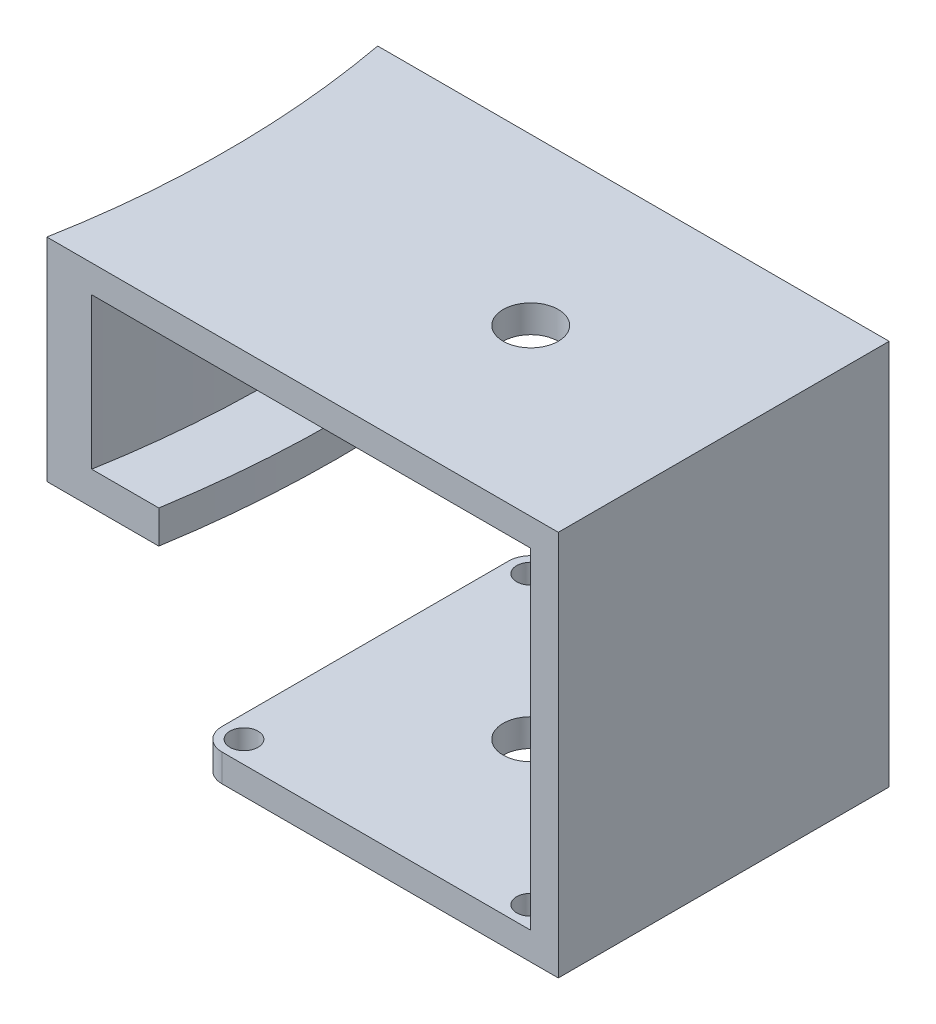
ISO-10303-21;
HEADER;
FILE_DESCRIPTION(('STEP AP214'),'2;1');
FILE_NAME('part.step','',(''),(''),'','','');
FILE_SCHEMA(('AUTOMOTIVE_DESIGN { 1 0 10303 214 1 1 1 1 }'));
ENDSEC;
DATA;
#1=APPLICATION_CONTEXT('core data for automotive mechanical design processes');
#2=APPLICATION_PROTOCOL_DEFINITION('international standard','automotive_design',2000,#1);
#3=PRODUCT_CONTEXT('',#1,'mechanical');
#4=PRODUCT('Part','Part','',(#3));
#5=PRODUCT_RELATED_PRODUCT_CATEGORY('part','',(#4));
#6=PRODUCT_DEFINITION_FORMATION('','',#4);
#7=PRODUCT_DEFINITION_CONTEXT('part definition',#1,'design');
#8=PRODUCT_DEFINITION('design','',#6,#7);
#9=PRODUCT_DEFINITION_SHAPE('','',#8);
#10=(LENGTH_UNIT() NAMED_UNIT(*) SI_UNIT(.MILLI.,.METRE.));
#11=(NAMED_UNIT(*) PLANE_ANGLE_UNIT() SI_UNIT($,.RADIAN.));
#12=(NAMED_UNIT(*) SI_UNIT($,.STERADIAN.) SOLID_ANGLE_UNIT());
#13=UNCERTAINTY_MEASURE_WITH_UNIT(LENGTH_MEASURE(1.E-05),#10,'distance_accuracy_value','');
#14=(GEOMETRIC_REPRESENTATION_CONTEXT(3) GLOBAL_UNCERTAINTY_ASSIGNED_CONTEXT((#13)) GLOBAL_UNIT_ASSIGNED_CONTEXT((#10,
#11,#12)) REPRESENTATION_CONTEXT('',''));
#15=CARTESIAN_POINT('',(0.,0.,0.));
#16=DIRECTION('',(0.,0.,1.));
#17=DIRECTION('',(1.,0.,0.));
#18=AXIS2_PLACEMENT_3D('',#15,#16,#17);
#19=CARTESIAN_POINT('',(30.,70.,-30.));
#20=DIRECTION('',(-1.,0.,0.));
#21=DIRECTION('',(0.,0.,1.));
#22=AXIS2_PLACEMENT_3D('',#19,#20,#21);
#23=PLANE('',#22);
#24=DIRECTION('',(0.,-1.,0.));
#25=VECTOR('',#24,1.);
#26=CARTESIAN_POINT('',(30.,70.,30.));
#27=LINE('',#26,#25);
#28=CARTESIAN_POINT('',(30.,65.,30.));
#29=VERTEX_POINT('',#28);
#30=CARTESIAN_POINT('',(30.,5.,30.));
#31=VERTEX_POINT('',#30);
#32=EDGE_CURVE('E204',#29,#31,#27,.T.);
#33=ORIENTED_EDGE('',*,*,#32,.F.);
#34=DIRECTION('',(0.,0.,-1.));
#35=VECTOR('',#34,1.);
#36=CARTESIAN_POINT('',(30.,65.,30.));
#37=LINE('',#36,#35);
#38=CARTESIAN_POINT('',(30.,65.,-30.));
#39=VERTEX_POINT('',#38);
#40=EDGE_CURVE('E53',#29,#39,#37,.T.);
#41=ORIENTED_EDGE('',*,*,#40,.T.);
#42=DIRECTION('',(0.,-1.,0.));
#43=VECTOR('',#42,1.);
#44=CARTESIAN_POINT('',(30.,70.,-30.));
#45=LINE('',#44,#43);
#46=CARTESIAN_POINT('',(30.,5.,-30.));
#47=VERTEX_POINT('',#46);
#48=EDGE_CURVE('E201',#39,#47,#45,.T.);
#49=ORIENTED_EDGE('',*,*,#48,.T.);
#50=DIRECTION('',(0.,0.,-1.));
#51=VECTOR('',#50,1.);
#52=CARTESIAN_POINT('',(30.,5.,30.));
#53=LINE('',#52,#51);
#54=EDGE_CURVE('E242',#31,#47,#53,.T.);
#55=ORIENTED_EDGE('',*,*,#54,.F.);
#56=EDGE_LOOP('',(#33,#41,#49,#55));
#57=FACE_BOUND('',#56,.T.);
#58=ADVANCED_FACE('F38',(#57),#23,.T.);
#59=CARTESIAN_POINT('',(-26.,5.,-26.));
#60=DIRECTION('',(0.,-1.,0.));
#61=DIRECTION('',(0.,0.,-1.));
#62=AXIS2_PLACEMENT_3D('',#59,#60,#61);
#63=PLANE('',#62);
#64=CARTESIAN_POINT('',(0.,5.,0.));
#65=DIRECTION('',(0.,1.,0.));
#66=DIRECTION('',(0.,0.,1.));
#67=AXIS2_PLACEMENT_3D('',#64,#65,#66);
#68=CIRCLE('',#67,5.);
#69=CARTESIAN_POINT('',(0.,5.,5.));
#70=VERTEX_POINT('',#69);
#71=EDGE_CURVE('E206',#70,#70,#68,.T.);
#72=ORIENTED_EDGE('',*,*,#71,.F.);
#73=EDGE_LOOP('',(#72));
#74=FACE_BOUND('',#73,.T.);
#75=ORIENTED_EDGE('',*,*,#54,.T.);
#76=DIRECTION('',(-1.,0.,0.));
#77=VECTOR('',#76,1.);
#78=CARTESIAN_POINT('',(-26.,5.,-30.));
#79=LINE('',#78,#77);
#80=CARTESIAN_POINT('',(-26.,5.,-30.));
#81=VERTEX_POINT('',#80);
#82=EDGE_CURVE('E245',#47,#81,#79,.T.);
#83=ORIENTED_EDGE('',*,*,#82,.T.);
#84=CARTESIAN_POINT('',(-26.,5.,-26.));
#85=DIRECTION('',(0.,1.,0.));
#86=DIRECTION('',(0.,0.,-1.));
#87=AXIS2_PLACEMENT_3D('',#84,#85,#86);
#88=CIRCLE('',#87,4.);
#89=CARTESIAN_POINT('',(-30.,5.,-26.));
#90=VERTEX_POINT('',#89);
#91=EDGE_CURVE('E248',#81,#90,#88,.T.);
#92=ORIENTED_EDGE('',*,*,#91,.T.);
#93=DIRECTION('',(0.,0.,1.));
#94=VECTOR('',#93,1.);
#95=CARTESIAN_POINT('',(-30.,5.,26.));
#96=LINE('',#95,#94);
#97=CARTESIAN_POINT('',(-30.,5.,26.));
#98=VERTEX_POINT('',#97);
#99=EDGE_CURVE('E250',#90,#98,#96,.T.);
#100=ORIENTED_EDGE('',*,*,#99,.T.);
#101=CARTESIAN_POINT('',(-26.,5.,26.));
#102=DIRECTION('',(0.,1.,0.));
#103=DIRECTION('',(0.,0.,-1.));
#104=AXIS2_PLACEMENT_3D('',#101,#102,#103);
#105=CIRCLE('',#104,4.);
#106=CARTESIAN_POINT('',(-26.,5.,30.));
#107=VERTEX_POINT('',#106);
#108=EDGE_CURVE('E252',#98,#107,#105,.T.);
#109=ORIENTED_EDGE('',*,*,#108,.T.);
#110=DIRECTION('',(1.,0.,0.));
#111=VECTOR('',#110,1.);
#112=CARTESIAN_POINT('',(-26.,5.,30.));
#113=LINE('',#112,#111);
#114=EDGE_CURVE('E254',#107,#31,#113,.T.);
#115=ORIENTED_EDGE('',*,*,#114,.T.);
#116=EDGE_LOOP('',(#75,#83,#92,#100,#109,#115));
#117=FACE_BOUND('',#116,.T.);
#118=CARTESIAN_POINT('',(26.,5.,-26.));
#119=DIRECTION('',(0.,1.,0.));
#120=DIRECTION('',(0.,0.,1.));
#121=AXIS2_PLACEMENT_3D('',#118,#119,#120);
#122=CIRCLE('',#121,2.55);
#123=CARTESIAN_POINT('',(26.,5.,-23.45));
#124=VERTEX_POINT('',#123);
#125=EDGE_CURVE('E236',#124,#124,#122,.T.);
#126=ORIENTED_EDGE('',*,*,#125,.F.);
#127=EDGE_LOOP('',(#126));
#128=FACE_BOUND('',#127,.T.);
#129=CARTESIAN_POINT('',(-26.,5.,-26.));
#130=DIRECTION('',(0.,1.,0.));
#131=DIRECTION('',(0.,0.,1.));
#132=AXIS2_PLACEMENT_3D('',#129,#130,#131);
#133=CIRCLE('',#132,2.55);
#134=CARTESIAN_POINT('',(-26.,5.,-23.45));
#135=VERTEX_POINT('',#134);
#136=EDGE_CURVE('E230',#135,#135,#133,.T.);
#137=ORIENTED_EDGE('',*,*,#136,.F.);
#138=EDGE_LOOP('',(#137));
#139=FACE_BOUND('',#138,.T.);
#140=CARTESIAN_POINT('',(-26.,5.,26.));
#141=DIRECTION('',(0.,1.,0.));
#142=DIRECTION('',(0.,0.,1.));
#143=AXIS2_PLACEMENT_3D('',#140,#141,#142);
#144=CIRCLE('',#143,2.55);
#145=CARTESIAN_POINT('',(-26.,5.,28.55));
#146=VERTEX_POINT('',#145);
#147=EDGE_CURVE('E224',#146,#146,#144,.T.);
#148=ORIENTED_EDGE('',*,*,#147,.F.);
#149=EDGE_LOOP('',(#148));
#150=FACE_BOUND('',#149,.T.);
#151=CARTESIAN_POINT('',(26.,5.,26.));
#152=DIRECTION('',(0.,1.,0.));
#153=DIRECTION('',(0.,0.,1.));
#154=AXIS2_PLACEMENT_3D('',#151,#152,#153);
#155=CIRCLE('',#154,2.55);
#156=CARTESIAN_POINT('',(26.,5.,28.55));
#157=VERTEX_POINT('',#156);
#158=EDGE_CURVE('E217',#157,#157,#155,.T.);
#159=ORIENTED_EDGE('',*,*,#158,.F.);
#160=EDGE_LOOP('',(#159));
#161=FACE_BOUND('',#160,.T.);
#162=ADVANCED_FACE('F284',(#74,#117,#128,#139,#150,#161),#63,.F.);
#163=CARTESIAN_POINT('',(-26.,0.,-26.));
#164=DIRECTION('',(0.,-1.,0.));
#165=DIRECTION('',(0.,0.,-1.));
#166=AXIS2_PLACEMENT_3D('',#163,#164,#165);
#167=PLANE('',#166);
#168=CARTESIAN_POINT('',(0.,0.,0.));
#169=DIRECTION('',(0.,-1.,0.));
#170=DIRECTION('',(0.,0.,-1.));
#171=AXIS2_PLACEMENT_3D('',#168,#169,#170);
#172=CIRCLE('',#171,5.);
#173=CARTESIAN_POINT('',(0.,0.,-5.));
#174=VERTEX_POINT('',#173);
#175=EDGE_CURVE('E216',#174,#174,#172,.T.);
#176=ORIENTED_EDGE('',*,*,#175,.F.);
#177=EDGE_LOOP('',(#176));
#178=FACE_BOUND('',#177,.T.);
#179=CARTESIAN_POINT('',(-26.,0.,26.));
#180=DIRECTION('',(0.,1.,0.));
#181=DIRECTION('',(0.,0.,1.));
#182=AXIS2_PLACEMENT_3D('',#179,#180,#181);
#183=CIRCLE('',#182,2.55);
#184=CARTESIAN_POINT('',(-26.,0.,28.55));
#185=VERTEX_POINT('',#184);
#186=EDGE_CURVE('E220',#185,#185,#183,.T.);
#187=ORIENTED_EDGE('',*,*,#186,.T.);
#188=EDGE_LOOP('',(#187));
#189=FACE_BOUND('',#188,.T.);
#190=CARTESIAN_POINT('',(26.,0.,-26.));
#191=DIRECTION('',(0.,1.,0.));
#192=DIRECTION('',(0.,0.,1.));
#193=AXIS2_PLACEMENT_3D('',#190,#191,#192);
#194=CIRCLE('',#193,2.55);
#195=CARTESIAN_POINT('',(26.,0.,-23.45));
#196=VERTEX_POINT('',#195);
#197=EDGE_CURVE('E233',#196,#196,#194,.T.);
#198=ORIENTED_EDGE('',*,*,#197,.T.);
#199=EDGE_LOOP('',(#198));
#200=FACE_BOUND('',#199,.T.);
#201=DIRECTION('',(-1.,0.,0.));
#202=VECTOR('',#201,1.);
#203=CARTESIAN_POINT('',(-26.,0.,-30.));
#204=LINE('',#203,#202);
#205=CARTESIAN_POINT('',(35.,0.,-30.));
#206=VERTEX_POINT('',#205);
#207=CARTESIAN_POINT('',(-26.,0.,-30.));
#208=VERTEX_POINT('',#207);
#209=EDGE_CURVE('E239',#206,#208,#204,.T.);
#210=ORIENTED_EDGE('',*,*,#209,.F.);
#211=DIRECTION('',(0.,0.,1.));
#212=VECTOR('',#211,1.);
#213=CARTESIAN_POINT('',(35.,0.,-30.));
#214=LINE('',#213,#212);
#215=CARTESIAN_POINT('',(35.,0.,30.));
#216=VERTEX_POINT('',#215);
#217=EDGE_CURVE('E193',#206,#216,#214,.T.);
#218=ORIENTED_EDGE('',*,*,#217,.T.);
#219=DIRECTION('',(1.,0.,0.));
#220=VECTOR('',#219,1.);
#221=CARTESIAN_POINT('',(-26.,0.,30.));
#222=LINE('',#221,#220);
#223=CARTESIAN_POINT('',(-26.,0.,30.));
#224=VERTEX_POINT('',#223);
#225=EDGE_CURVE('E246',#224,#216,#222,.T.);
#226=ORIENTED_EDGE('',*,*,#225,.F.);
#227=CARTESIAN_POINT('',(-26.,0.,26.));
#228=DIRECTION('',(0.,1.,0.));
#229=DIRECTION('',(0.,0.,-1.));
#230=AXIS2_PLACEMENT_3D('',#227,#228,#229);
#231=CIRCLE('',#230,4.);
#232=CARTESIAN_POINT('',(-30.,0.,26.));
#233=VERTEX_POINT('',#232);
#234=EDGE_CURVE('E263',#233,#224,#231,.T.);
#235=ORIENTED_EDGE('',*,*,#234,.F.);
#236=DIRECTION('',(0.,0.,1.));
#237=VECTOR('',#236,1.);
#238=CARTESIAN_POINT('',(-30.,0.,26.));
#239=LINE('',#238,#237);
#240=CARTESIAN_POINT('',(-30.,0.,-26.));
#241=VERTEX_POINT('',#240);
#242=EDGE_CURVE('E261',#241,#233,#239,.T.);
#243=ORIENTED_EDGE('',*,*,#242,.F.);
#244=CARTESIAN_POINT('',(-26.,0.,-26.));
#245=DIRECTION('',(0.,1.,0.));
#246=DIRECTION('',(0.,0.,-1.));
#247=AXIS2_PLACEMENT_3D('',#244,#245,#246);
#248=CIRCLE('',#247,4.);
#249=EDGE_CURVE('E259',#208,#241,#248,.T.);
#250=ORIENTED_EDGE('',*,*,#249,.F.);
#251=EDGE_LOOP('',(#210,#218,#226,#235,#243,#250));
#252=FACE_BOUND('',#251,.T.);
#253=CARTESIAN_POINT('',(-26.,0.,-26.));
#254=DIRECTION('',(0.,1.,0.));
#255=DIRECTION('',(0.,0.,1.));
#256=AXIS2_PLACEMENT_3D('',#253,#254,#255);
#257=CIRCLE('',#256,2.55);
#258=CARTESIAN_POINT('',(-26.,0.,-23.45));
#259=VERTEX_POINT('',#258);
#260=EDGE_CURVE('E227',#259,#259,#257,.T.);
#261=ORIENTED_EDGE('',*,*,#260,.T.);
#262=EDGE_LOOP('',(#261));
#263=FACE_BOUND('',#262,.T.);
#264=CARTESIAN_POINT('',(26.,0.,26.));
#265=DIRECTION('',(0.,1.,0.));
#266=DIRECTION('',(0.,0.,1.));
#267=AXIS2_PLACEMENT_3D('',#264,#265,#266);
#268=CIRCLE('',#267,2.55);
#269=CARTESIAN_POINT('',(26.,0.,28.55));
#270=VERTEX_POINT('',#269);
#271=EDGE_CURVE('E221',#270,#270,#268,.T.);
#272=ORIENTED_EDGE('',*,*,#271,.T.);
#273=EDGE_LOOP('',(#272));
#274=FACE_BOUND('',#273,.T.);
#275=ADVANCED_FACE('F281',(#178,#189,#200,#252,#263,#274),#167,.T.);
#276=CARTESIAN_POINT('',(-26.,5.,-30.));
#277=DIRECTION('',(0.,0.,1.));
#278=DIRECTION('',(1.,0.,0.));
#279=AXIS2_PLACEMENT_3D('',#276,#277,#278);
#280=PLANE('',#279);
#281=DIRECTION('',(-1.,0.,0.));
#282=VECTOR('',#281,1.);
#283=CARTESIAN_POINT('',(30.,65.,-30.));
#284=LINE('',#283,#282);
#285=CARTESIAN_POINT('',(-49.6210106850026,65.,-30.));
#286=VERTEX_POINT('',#285);
#287=EDGE_CURVE('E191',#39,#286,#284,.T.);
#288=ORIENTED_EDGE('',*,*,#287,.T.);
#289=DIRECTION('',(0.,1.,0.));
#290=VECTOR('',#289,1.);
#291=CARTESIAN_POINT('',(-49.6210106850026,-23.3554480011892,-30.));
#292=LINE('',#291,#290);
#293=CARTESIAN_POINT('',(-49.6210106850026,37.6,-30.));
#294=VERTEX_POINT('',#293);
#295=EDGE_CURVE('E147',#294,#286,#292,.T.);
#296=ORIENTED_EDGE('',*,*,#295,.F.);
#297=DIRECTION('',(-1.,0.,0.));
#298=VECTOR('',#297,1.);
#299=CARTESIAN_POINT('',(-37.4486373647132,37.6,-30.));
#300=LINE('',#299,#298);
#301=CARTESIAN_POINT('',(-37.4486373647132,37.6,-30.));
#302=VERTEX_POINT('',#301);
#303=EDGE_CURVE('E140',#302,#294,#300,.T.);
#304=ORIENTED_EDGE('',*,*,#303,.F.);
#305=DIRECTION('',(0.,-1.,0.));
#306=VECTOR('',#305,1.);
#307=CARTESIAN_POINT('',(-37.4486373647132,37.6,-30.));
#308=LINE('',#307,#306);
#309=CARTESIAN_POINT('',(-37.4486373647132,31.6,-30.));
#310=VERTEX_POINT('',#309);
#311=EDGE_CURVE('E145',#302,#310,#308,.T.);
#312=ORIENTED_EDGE('',*,*,#311,.T.);
#313=DIRECTION('',(-1.,0.,0.));
#314=VECTOR('',#313,1.);
#315=CARTESIAN_POINT('',(-37.4486373647132,31.6,-30.));
#316=LINE('',#315,#314);
#317=CARTESIAN_POINT('',(-57.7501926041205,31.6,-29.9999999999999));
#318=VERTEX_POINT('',#317);
#319=EDGE_CURVE('E572',#310,#318,#316,.T.);
#320=ORIENTED_EDGE('',*,*,#319,.T.);
#321=DIRECTION('',(0.,1.,0.));
#322=VECTOR('',#321,1.);
#323=CARTESIAN_POINT('',(-57.7501926041205,-23.3554480011892,-29.9999999999999));
#324=LINE('',#323,#322);
#325=CARTESIAN_POINT('',(-57.7501926041205,70.,-29.9999999999999));
#326=VERTEX_POINT('',#325);
#327=EDGE_CURVE('E175',#318,#326,#324,.T.);
#328=ORIENTED_EDGE('',*,*,#327,.T.);
#329=DIRECTION('',(1.,0.,0.));
#330=VECTOR('',#329,1.);
#331=CARTESIAN_POINT('',(30.,70.,-30.));
#332=LINE('',#331,#330);
#333=CARTESIAN_POINT('',(35.,70.,-30.));
#334=VERTEX_POINT('',#333);
#335=EDGE_CURVE('E194',#326,#334,#332,.T.);
#336=ORIENTED_EDGE('',*,*,#335,.T.);
#337=DIRECTION('',(0.,-1.,0.));
#338=VECTOR('',#337,1.);
#339=CARTESIAN_POINT('',(35.,70.,-30.));
#340=LINE('',#339,#338);
#341=EDGE_CURVE('E210',#334,#206,#340,.T.);
#342=ORIENTED_EDGE('',*,*,#341,.T.);
#343=ORIENTED_EDGE('',*,*,#209,.T.);
#344=DIRECTION('',(0.,-1.,0.));
#345=VECTOR('',#344,1.);
#346=CARTESIAN_POINT('',(-26.,5.,-30.));
#347=LINE('',#346,#345);
#348=EDGE_CURVE('E46',#81,#208,#347,.T.);
#349=ORIENTED_EDGE('',*,*,#348,.F.);
#350=ORIENTED_EDGE('',*,*,#82,.F.);
#351=ORIENTED_EDGE('',*,*,#48,.F.);
#352=EDGE_LOOP('',(#288,#296,#304,#312,#320,#328,#336,#342,#343,#349,#350,#351));
#353=FACE_BOUND('',#352,.T.);
#354=ADVANCED_FACE('F40',(#353),#280,.F.);
#355=CARTESIAN_POINT('',(-26.,5.,-26.));
#356=DIRECTION('',(0.,-1.,0.));
#357=DIRECTION('',(0.,0.,-1.));
#358=AXIS2_PLACEMENT_3D('',#355,#356,#357);
#359=CYLINDRICAL_SURFACE('',#358,4.);
#360=ORIENTED_EDGE('',*,*,#249,.T.);
#361=DIRECTION('',(0.,-1.,0.));
#362=VECTOR('',#361,1.);
#363=CARTESIAN_POINT('',(-30.,5.,-26.));
#364=LINE('',#363,#362);
#365=EDGE_CURVE('E271',#90,#241,#364,.T.);
#366=ORIENTED_EDGE('',*,*,#365,.F.);
#367=ORIENTED_EDGE('',*,*,#91,.F.);
#368=ORIENTED_EDGE('',*,*,#348,.T.);
#369=EDGE_LOOP('',(#360,#366,#367,#368));
#370=FACE_BOUND('',#369,.T.);
#371=ADVANCED_FACE('F395',(#370),#359,.T.);
#372=CARTESIAN_POINT('',(-30.,5.,26.));
#373=DIRECTION('',(1.,0.,0.));
#374=DIRECTION('',(0.,0.,-1.));
#375=AXIS2_PLACEMENT_3D('',#372,#373,#374);
#376=PLANE('',#375);
#377=ORIENTED_EDGE('',*,*,#242,.T.);
#378=DIRECTION('',(0.,-1.,0.));
#379=VECTOR('',#378,1.);
#380=CARTESIAN_POINT('',(-30.,5.,26.));
#381=LINE('',#380,#379);
#382=EDGE_CURVE('E268',#98,#233,#381,.T.);
#383=ORIENTED_EDGE('',*,*,#382,.F.);
#384=ORIENTED_EDGE('',*,*,#99,.F.);
#385=ORIENTED_EDGE('',*,*,#365,.T.);
#386=EDGE_LOOP('',(#377,#383,#384,#385));
#387=FACE_BOUND('',#386,.T.);
#388=ADVANCED_FACE('F515',(#387),#376,.F.);
#389=CARTESIAN_POINT('',(-26.,5.,26.));
#390=DIRECTION('',(0.,-1.,0.));
#391=DIRECTION('',(0.,0.,-1.));
#392=AXIS2_PLACEMENT_3D('',#389,#390,#391);
#393=CYLINDRICAL_SURFACE('',#392,4.);
#394=ORIENTED_EDGE('',*,*,#234,.T.);
#395=DIRECTION('',(0.,-1.,0.));
#396=VECTOR('',#395,1.);
#397=CARTESIAN_POINT('',(-26.,5.,30.));
#398=LINE('',#397,#396);
#399=EDGE_CURVE('E257',#107,#224,#398,.T.);
#400=ORIENTED_EDGE('',*,*,#399,.F.);
#401=ORIENTED_EDGE('',*,*,#108,.F.);
#402=ORIENTED_EDGE('',*,*,#382,.T.);
#403=EDGE_LOOP('',(#394,#400,#401,#402));
#404=FACE_BOUND('',#403,.T.);
#405=ADVANCED_FACE('F372',(#404),#393,.T.);
#406=CARTESIAN_POINT('',(-26.,5.,30.));
#407=DIRECTION('',(0.,0.,-1.));
#408=DIRECTION('',(-1.,0.,0.));
#409=AXIS2_PLACEMENT_3D('',#406,#407,#408);
#410=PLANE('',#409);
#411=DIRECTION('',(-1.,0.,0.));
#412=VECTOR('',#411,1.);
#413=CARTESIAN_POINT('',(30.,70.,30.));
#414=LINE('',#413,#412);
#415=CARTESIAN_POINT('',(35.,70.,30.));
#416=VERTEX_POINT('',#415);
#417=CARTESIAN_POINT('',(-57.7501926041205,70.,30.));
#418=VERTEX_POINT('',#417);
#419=EDGE_CURVE('E199',#416,#418,#414,.T.);
#420=ORIENTED_EDGE('',*,*,#419,.T.);
#421=DIRECTION('',(0.,1.,0.));
#422=VECTOR('',#421,1.);
#423=CARTESIAN_POINT('',(-57.7501926041205,-23.3554480011892,30.));
#424=LINE('',#423,#422);
#425=CARTESIAN_POINT('',(-57.7501926041205,31.6,30.));
#426=VERTEX_POINT('',#425);
#427=EDGE_CURVE('E168',#426,#418,#424,.T.);
#428=ORIENTED_EDGE('',*,*,#427,.F.);
#429=DIRECTION('',(1.,0.,0.));
#430=VECTOR('',#429,1.);
#431=CARTESIAN_POINT('',(-37.4486373647132,31.6,30.0000000000001));
#432=LINE('',#431,#430);
#433=CARTESIAN_POINT('',(-37.4486373647132,31.6,30.0000000000001));
#434=VERTEX_POINT('',#433);
#435=EDGE_CURVE('E159',#426,#434,#432,.T.);
#436=ORIENTED_EDGE('',*,*,#435,.T.);
#437=DIRECTION('',(0.,-1.,0.));
#438=VECTOR('',#437,1.);
#439=CARTESIAN_POINT('',(-37.4486373647132,37.6,30.0000000000001));
#440=LINE('',#439,#438);
#441=CARTESIAN_POINT('',(-37.4486373647132,37.6,30.0000000000001));
#442=VERTEX_POINT('',#441);
#443=EDGE_CURVE('E165',#442,#434,#440,.T.);
#444=ORIENTED_EDGE('',*,*,#443,.F.);
#445=DIRECTION('',(1.,0.,0.));
#446=VECTOR('',#445,1.);
#447=CARTESIAN_POINT('',(-37.4486373647132,37.6,30.0000000000001));
#448=LINE('',#447,#446);
#449=CARTESIAN_POINT('',(-49.6210106850026,37.6,30.));
#450=VERTEX_POINT('',#449);
#451=EDGE_CURVE('E151',#450,#442,#448,.T.);
#452=ORIENTED_EDGE('',*,*,#451,.F.);
#453=DIRECTION('',(0.,1.,0.));
#454=VECTOR('',#453,1.);
#455=CARTESIAN_POINT('',(-49.6210106850026,-23.3554480011892,30.));
#456=LINE('',#455,#454);
#457=CARTESIAN_POINT('',(-49.6210106850026,65.,30.));
#458=VERTEX_POINT('',#457);
#459=EDGE_CURVE('E180',#450,#458,#456,.T.);
#460=ORIENTED_EDGE('',*,*,#459,.T.);
#461=DIRECTION('',(1.,0.,0.));
#462=VECTOR('',#461,1.);
#463=CARTESIAN_POINT('',(-50.,65.,30.));
#464=LINE('',#463,#462);
#465=EDGE_CURVE('E61',#458,#29,#464,.T.);
#466=ORIENTED_EDGE('',*,*,#465,.T.);
#467=ORIENTED_EDGE('',*,*,#32,.T.);
#468=ORIENTED_EDGE('',*,*,#114,.F.);
#469=ORIENTED_EDGE('',*,*,#399,.T.);
#470=ORIENTED_EDGE('',*,*,#225,.T.);
#471=DIRECTION('',(0.,-1.,0.));
#472=VECTOR('',#471,1.);
#473=CARTESIAN_POINT('',(35.,70.,30.));
#474=LINE('',#473,#472);
#475=EDGE_CURVE('E207',#416,#216,#474,.T.);
#476=ORIENTED_EDGE('',*,*,#475,.F.);
#477=EDGE_LOOP('',(#420,#428,#436,#444,#452,#460,#466,#467,#468,#469,#470,#476));
#478=FACE_BOUND('',#477,.T.);
#479=ADVANCED_FACE('F364',(#478),#410,.F.);
#480=CARTESIAN_POINT('',(26.,5.,-26.));
#481=DIRECTION('',(0.,-1.,0.));
#482=DIRECTION('',(0.,0.,-1.));
#483=AXIS2_PLACEMENT_3D('',#480,#481,#482);
#484=CYLINDRICAL_SURFACE('',#483,2.55);
#485=ORIENTED_EDGE('',*,*,#125,.T.);
#486=EDGE_LOOP('',(#485));
#487=FACE_BOUND('',#486,.T.);
#488=ORIENTED_EDGE('',*,*,#197,.F.);
#489=EDGE_LOOP('',(#488));
#490=FACE_BOUND('',#489,.T.);
#491=ADVANCED_FACE('F371',(#487,#490),#484,.F.);
#492=CARTESIAN_POINT('',(-26.,5.,-26.));
#493=DIRECTION('',(0.,-1.,0.));
#494=DIRECTION('',(0.,0.,-1.));
#495=AXIS2_PLACEMENT_3D('',#492,#493,#494);
#496=CYLINDRICAL_SURFACE('',#495,2.55);
#497=ORIENTED_EDGE('',*,*,#136,.T.);
#498=EDGE_LOOP('',(#497));
#499=FACE_BOUND('',#498,.T.);
#500=ORIENTED_EDGE('',*,*,#260,.F.);
#501=EDGE_LOOP('',(#500));
#502=FACE_BOUND('',#501,.T.);
#503=ADVANCED_FACE('F307',(#499,#502),#496,.F.);
#504=CARTESIAN_POINT('',(-26.,5.,26.));
#505=DIRECTION('',(0.,-1.,0.));
#506=DIRECTION('',(0.,0.,-1.));
#507=AXIS2_PLACEMENT_3D('',#504,#505,#506);
#508=CYLINDRICAL_SURFACE('',#507,2.55);
#509=ORIENTED_EDGE('',*,*,#147,.T.);
#510=EDGE_LOOP('',(#509));
#511=FACE_BOUND('',#510,.T.);
#512=ORIENTED_EDGE('',*,*,#186,.F.);
#513=EDGE_LOOP('',(#512));
#514=FACE_BOUND('',#513,.T.);
#515=ADVANCED_FACE('F298',(#511,#514),#508,.F.);
#516=CARTESIAN_POINT('',(26.,5.,26.));
#517=DIRECTION('',(0.,-1.,0.));
#518=DIRECTION('',(0.,0.,-1.));
#519=AXIS2_PLACEMENT_3D('',#516,#517,#518);
#520=CYLINDRICAL_SURFACE('',#519,2.55);
#521=ORIENTED_EDGE('',*,*,#158,.T.);
#522=EDGE_LOOP('',(#521));
#523=FACE_BOUND('',#522,.T.);
#524=ORIENTED_EDGE('',*,*,#271,.F.);
#525=EDGE_LOOP('',(#524));
#526=FACE_BOUND('',#525,.T.);
#527=ADVANCED_FACE('F296',(#523,#526),#520,.F.);
#528=CARTESIAN_POINT('',(0.,-5.,0.));
#529=DIRECTION('',(0.,1.,0.));
#530=DIRECTION('',(0.,0.,1.));
#531=AXIS2_PLACEMENT_3D('',#528,#529,#530);
#532=CYLINDRICAL_SURFACE('',#531,5.);
#533=ORIENTED_EDGE('',*,*,#175,.T.);
#534=EDGE_LOOP('',(#533));
#535=FACE_BOUND('',#534,.T.);
#536=ORIENTED_EDGE('',*,*,#71,.T.);
#537=EDGE_LOOP('',(#536));
#538=FACE_BOUND('',#537,.T.);
#539=ADVANCED_FACE('F278',(#535,#538),#532,.F.);
#540=CARTESIAN_POINT('',(35.,70.,-30.));
#541=DIRECTION('',(1.,0.,0.));
#542=DIRECTION('',(0.,0.,-1.));
#543=AXIS2_PLACEMENT_3D('',#540,#541,#542);
#544=PLANE('',#543);
#545=ORIENTED_EDGE('',*,*,#217,.F.);
#546=ORIENTED_EDGE('',*,*,#341,.F.);
#547=DIRECTION('',(0.,0.,1.));
#548=VECTOR('',#547,1.);
#549=CARTESIAN_POINT('',(35.,70.,-30.));
#550=LINE('',#549,#548);
#551=EDGE_CURVE('E196',#334,#416,#550,.T.);
#552=ORIENTED_EDGE('',*,*,#551,.T.);
#553=ORIENTED_EDGE('',*,*,#475,.T.);
#554=EDGE_LOOP('',(#545,#546,#552,#553));
#555=FACE_BOUND('',#554,.T.);
#556=ADVANCED_FACE('F305',(#555),#544,.T.);
#557=CARTESIAN_POINT('',(0.,70.,0.));
#558=DIRECTION('',(0.,1.,0.));
#559=DIRECTION('',(0.,0.,1.));
#560=AXIS2_PLACEMENT_3D('',#557,#558,#559);
#561=PLANE('',#560);
#562=ORIENTED_EDGE('',*,*,#551,.F.);
#563=ORIENTED_EDGE('',*,*,#335,.F.);
#564=CARTESIAN_POINT('',(-220.,70.,0.));
#565=DIRECTION('',(0.,1.,0.));
#566=DIRECTION('',(0.,0.,1.));
#567=AXIS2_PLACEMENT_3D('',#564,#565,#566);
#568=CIRCLE('',#567,165.);
#569=EDGE_CURVE('E164',#418,#326,#568,.T.);
#570=ORIENTED_EDGE('',*,*,#569,.F.);
#571=ORIENTED_EDGE('',*,*,#419,.F.);
#572=EDGE_LOOP('',(#562,#563,#570,#571));
#573=FACE_BOUND('',#572,.T.);
#574=CARTESIAN_POINT('',(0.,70.,0.));
#575=DIRECTION('',(0.,1.,0.));
#576=DIRECTION('',(0.,0.,1.));
#577=AXIS2_PLACEMENT_3D('',#574,#575,#576);
#578=CIRCLE('',#577,5.);
#579=CARTESIAN_POINT('',(0.,70.,5.));
#580=VERTEX_POINT('',#579);
#581=EDGE_CURVE('E174',#580,#580,#578,.T.);
#582=ORIENTED_EDGE('',*,*,#581,.F.);
#583=EDGE_LOOP('',(#582));
#584=FACE_BOUND('',#583,.T.);
#585=ADVANCED_FACE('F320',(#573,#584),#561,.T.);
#586=CARTESIAN_POINT('',(0.,65.,0.));
#587=DIRECTION('',(0.,1.,0.));
#588=DIRECTION('',(0.,0.,1.));
#589=AXIS2_PLACEMENT_3D('',#586,#587,#588);
#590=PLANE('',#589);
#591=CARTESIAN_POINT('',(0.,65.,0.));
#592=DIRECTION('',(0.,1.,0.));
#593=DIRECTION('',(0.,0.,1.));
#594=AXIS2_PLACEMENT_3D('',#591,#592,#593);
#595=CIRCLE('',#594,5.);
#596=CARTESIAN_POINT('',(0.,65.,5.));
#597=VERTEX_POINT('',#596);
#598=EDGE_CURVE('E184',#597,#597,#595,.T.);
#599=ORIENTED_EDGE('',*,*,#598,.T.);
#600=EDGE_LOOP('',(#599));
#601=FACE_BOUND('',#600,.T.);
#602=ORIENTED_EDGE('',*,*,#465,.F.);
#603=CARTESIAN_POINT('',(-220.,65.,0.));
#604=DIRECTION('',(0.,1.,0.));
#605=DIRECTION('',(0.,0.,1.));
#606=AXIS2_PLACEMENT_3D('',#603,#604,#605);
#607=CIRCLE('',#606,173.);
#608=EDGE_CURVE('E11',#458,#286,#607,.T.);
#609=ORIENTED_EDGE('',*,*,#608,.T.);
#610=ORIENTED_EDGE('',*,*,#287,.F.);
#611=ORIENTED_EDGE('',*,*,#40,.F.);
#612=EDGE_LOOP('',(#602,#609,#610,#611));
#613=FACE_BOUND('',#612,.T.);
#614=ADVANCED_FACE('F324',(#601,#613),#590,.F.);
#615=CARTESIAN_POINT('',(0.,65.,0.));
#616=DIRECTION('',(0.,1.,0.));
#617=DIRECTION('',(0.,0.,1.));
#618=AXIS2_PLACEMENT_3D('',#615,#616,#617);
#619=CYLINDRICAL_SURFACE('',#618,5.);
#620=ORIENTED_EDGE('',*,*,#598,.F.);
#621=EDGE_LOOP('',(#620));
#622=FACE_BOUND('',#621,.T.);
#623=ORIENTED_EDGE('',*,*,#581,.T.);
#624=EDGE_LOOP('',(#623));
#625=FACE_BOUND('',#624,.T.);
#626=ADVANCED_FACE('F328',(#622,#625),#619,.F.);
#627=CARTESIAN_POINT('',(-220.,-23.3554480011892,0.));
#628=DIRECTION('',(0.,1.,0.));
#629=DIRECTION('',(0.,0.,1.));
#630=AXIS2_PLACEMENT_3D('',#627,#628,#629);
#631=CYLINDRICAL_SURFACE('',#630,173.);
#632=ORIENTED_EDGE('',*,*,#608,.F.);
#633=ORIENTED_EDGE('',*,*,#459,.F.);
#634=CARTESIAN_POINT('',(-220.,37.6,0.));
#635=DIRECTION('',(0.,1.,0.));
#636=DIRECTION('',(0.,0.,1.));
#637=AXIS2_PLACEMENT_3D('',#634,#635,#636);
#638=CIRCLE('',#637,173.);
#639=EDGE_CURVE('E173',#294,#450,#638,.F.);
#640=ORIENTED_EDGE('',*,*,#639,.F.);
#641=ORIENTED_EDGE('',*,*,#295,.T.);
#642=EDGE_LOOP('',(#632,#633,#640,#641));
#643=FACE_BOUND('',#642,.T.);
#644=ADVANCED_FACE('F332',(#643),#631,.T.);
#645=CARTESIAN_POINT('',(-220.,-23.3554480011892,0.));
#646=DIRECTION('',(0.,1.,0.));
#647=DIRECTION('',(0.,0.,1.));
#648=AXIS2_PLACEMENT_3D('',#645,#646,#647);
#649=CYLINDRICAL_SURFACE('',#648,165.);
#650=ORIENTED_EDGE('',*,*,#327,.F.);
#651=CARTESIAN_POINT('',(-220.,31.6,0.));
#652=DIRECTION('',(0.,-1.,0.));
#653=DIRECTION('',(0.,0.,1.));
#654=AXIS2_PLACEMENT_3D('',#651,#652,#653);
#655=CIRCLE('',#654,165.);
#656=EDGE_CURVE('E569',#318,#426,#655,.T.);
#657=ORIENTED_EDGE('',*,*,#656,.T.);
#658=ORIENTED_EDGE('',*,*,#427,.T.);
#659=ORIENTED_EDGE('',*,*,#569,.T.);
#660=EDGE_LOOP('',(#650,#657,#658,#659));
#661=FACE_BOUND('',#660,.T.);
#662=ADVANCED_FACE('F334',(#661),#649,.F.);
#663=CARTESIAN_POINT('',(-220.,37.6,0.));
#664=DIRECTION('',(0.,-1.,0.));
#665=DIRECTION('',(0.,0.,-1.));
#666=AXIS2_PLACEMENT_3D('',#663,#664,#665);
#667=CYLINDRICAL_SURFACE('',#666,185.);
#668=CARTESIAN_POINT('',(-220.,31.6,0.));
#669=DIRECTION('',(0.,1.,0.));
#670=DIRECTION('',(0.,0.,1.));
#671=AXIS2_PLACEMENT_3D('',#668,#669,#670);
#672=CIRCLE('',#671,185.);
#673=EDGE_CURVE('E163',#434,#310,#672,.T.);
#674=ORIENTED_EDGE('',*,*,#673,.T.);
#675=ORIENTED_EDGE('',*,*,#311,.F.);
#676=CARTESIAN_POINT('',(-220.,37.6,0.));
#677=DIRECTION('',(0.,1.,0.));
#678=DIRECTION('',(0.,0.,1.));
#679=AXIS2_PLACEMENT_3D('',#676,#677,#678);
#680=CIRCLE('',#679,185.);
#681=EDGE_CURVE('E152',#442,#302,#680,.T.);
#682=ORIENTED_EDGE('',*,*,#681,.F.);
#683=ORIENTED_EDGE('',*,*,#443,.T.);
#684=EDGE_LOOP('',(#674,#675,#682,#683));
#685=FACE_BOUND('',#684,.T.);
#686=ADVANCED_FACE('F161',(#685),#667,.T.);
#687=CARTESIAN_POINT('',(-220.,37.6,0.));
#688=DIRECTION('',(0.,1.,0.));
#689=DIRECTION('',(0.,0.,1.));
#690=AXIS2_PLACEMENT_3D('',#687,#688,#689);
#691=PLANE('',#690);
#692=ORIENTED_EDGE('',*,*,#303,.T.);
#693=ORIENTED_EDGE('',*,*,#639,.T.);
#694=ORIENTED_EDGE('',*,*,#451,.T.);
#695=ORIENTED_EDGE('',*,*,#681,.T.);
#696=EDGE_LOOP('',(#692,#693,#694,#695));
#697=FACE_BOUND('',#696,.T.);
#698=ADVANCED_FACE('F155',(#697),#691,.T.);
#699=CARTESIAN_POINT('',(-220.,31.6,0.));
#700=DIRECTION('',(0.,1.,0.));
#701=DIRECTION('',(0.,0.,1.));
#702=AXIS2_PLACEMENT_3D('',#699,#700,#701);
#703=PLANE('',#702);
#704=ORIENTED_EDGE('',*,*,#673,.F.);
#705=ORIENTED_EDGE('',*,*,#435,.F.);
#706=ORIENTED_EDGE('',*,*,#656,.F.);
#707=ORIENTED_EDGE('',*,*,#319,.F.);
#708=EDGE_LOOP('',(#704,#705,#706,#707));
#709=FACE_BOUND('',#708,.T.);
#710=ADVANCED_FACE('F343',(#709),#703,.F.);
#711=CLOSED_SHELL('',(#58,#162,#275,#354,#371,#388,#405,#479,#491,#503,#515,#527,#539,#556,#585,
#614,#626,#644,#662,#686,#698,#710));
#712=MANIFOLD_SOLID_BREP('B2',#711);
#713=ADVANCED_BREP_SHAPE_REPRESENTATION('',(#18,#712),#14);
#714=SHAPE_DEFINITION_REPRESENTATION(#9,#713);
ENDSEC;
END-ISO-10303-21;
